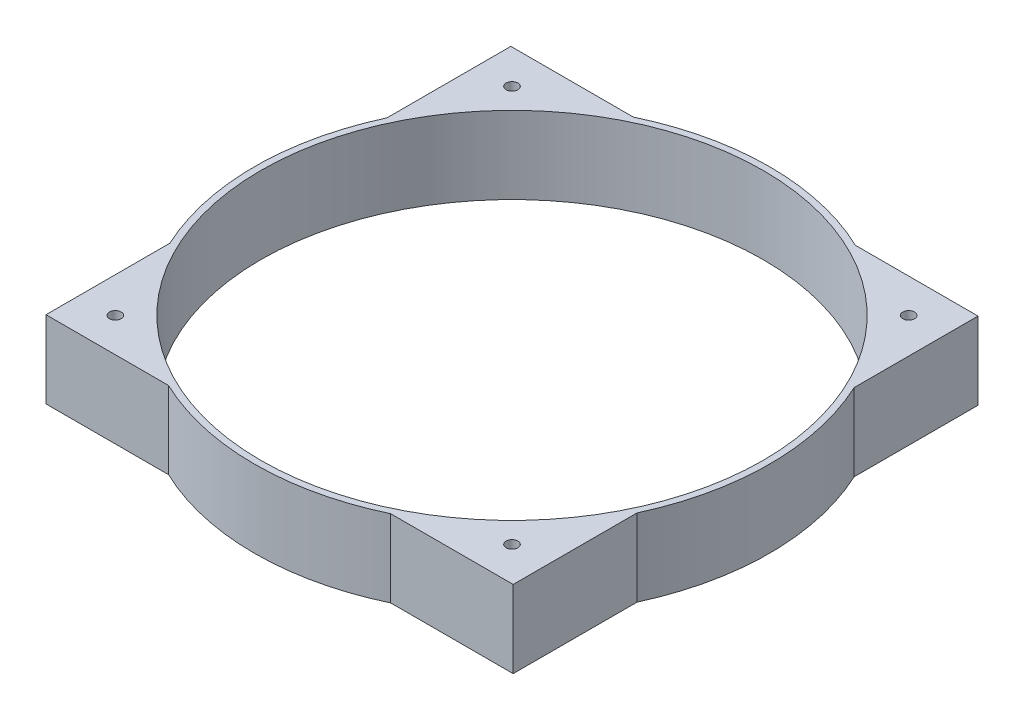
ISO-10303-21;
HEADER;
FILE_DESCRIPTION(('STEP AP214'),'2;1');
FILE_NAME('part.step','',(''),(''),'','','');
FILE_SCHEMA(('AUTOMOTIVE_DESIGN { 1 0 10303 214 1 1 1 1 }'));
ENDSEC;
DATA;
#1=APPLICATION_CONTEXT('core data for automotive mechanical design processes');
#2=APPLICATION_PROTOCOL_DEFINITION('international standard','automotive_design',2000,#1);
#3=PRODUCT_CONTEXT('',#1,'mechanical');
#4=PRODUCT('Part','Part','',(#3));
#5=PRODUCT_RELATED_PRODUCT_CATEGORY('part','',(#4));
#6=PRODUCT_DEFINITION_FORMATION('','',#4);
#7=PRODUCT_DEFINITION_CONTEXT('part definition',#1,'design');
#8=PRODUCT_DEFINITION('design','',#6,#7);
#9=PRODUCT_DEFINITION_SHAPE('','',#8);
#10=(LENGTH_UNIT() NAMED_UNIT(*) SI_UNIT(.MILLI.,.METRE.));
#11=(NAMED_UNIT(*) PLANE_ANGLE_UNIT() SI_UNIT($,.RADIAN.));
#12=(NAMED_UNIT(*) SI_UNIT($,.STERADIAN.) SOLID_ANGLE_UNIT());
#13=UNCERTAINTY_MEASURE_WITH_UNIT(LENGTH_MEASURE(1.E-05),#10,'distance_accuracy_value','');
#14=(GEOMETRIC_REPRESENTATION_CONTEXT(3) GLOBAL_UNCERTAINTY_ASSIGNED_CONTEXT((#13)) GLOBAL_UNIT_ASSIGNED_CONTEXT((#10,
#11,#12)) REPRESENTATION_CONTEXT('',''));
#15=CARTESIAN_POINT('',(0.,0.,0.));
#16=DIRECTION('',(0.,0.,1.));
#17=DIRECTION('',(1.,0.,0.));
#18=AXIS2_PLACEMENT_3D('',#15,#16,#17);
#19=CARTESIAN_POINT('',(0.,30.,0.));
#20=DIRECTION('',(0.,-1.,0.));
#21=DIRECTION('',(0.,0.,-1.));
#22=AXIS2_PLACEMENT_3D('',#19,#20,#21);
#23=CYLINDRICAL_SURFACE('',#22,100.);
#24=CARTESIAN_POINT('',(0.,30.,0.));
#25=DIRECTION('',(0.,1.,0.));
#26=DIRECTION('',(0.,0.,1.));
#27=AXIS2_PLACEMENT_3D('',#24,#25,#26);
#28=CIRCLE('',#27,100.);
#29=CARTESIAN_POINT('',(-90.6858149712351,30.,-42.1435993123856));
#30=VERTEX_POINT('',#29);
#31=CARTESIAN_POINT('',(-90.6858149712351,30.,42.1435993123856));
#32=VERTEX_POINT('',#31);
#33=EDGE_CURVE('E187',#30,#32,#28,.T.);
#34=ORIENTED_EDGE('',*,*,#33,.F.);
#35=DIRECTION('',(0.,-1.,0.));
#36=VECTOR('',#35,1.);
#37=CARTESIAN_POINT('',(-90.6858149712351,30.,-42.1435993123856));
#38=LINE('',#37,#36);
#39=CARTESIAN_POINT('',(-90.6858149712351,0.,-42.1435993123856));
#40=VERTEX_POINT('',#39);
#41=EDGE_CURVE('E141',#30,#40,#38,.T.);
#42=ORIENTED_EDGE('',*,*,#41,.T.);
#43=CARTESIAN_POINT('',(0.,0.,0.));
#44=DIRECTION('',(0.,1.,0.));
#45=DIRECTION('',(0.,0.,1.));
#46=AXIS2_PLACEMENT_3D('',#43,#44,#45);
#47=CIRCLE('',#46,100.);
#48=CARTESIAN_POINT('',(-90.6858149712351,0.,42.1435993123856));
#49=VERTEX_POINT('',#48);
#50=EDGE_CURVE('E190',#40,#49,#47,.T.);
#51=ORIENTED_EDGE('',*,*,#50,.T.);
#52=DIRECTION('',(0.,-1.,0.));
#53=VECTOR('',#52,1.);
#54=CARTESIAN_POINT('',(-90.6858149712351,30.,42.1435993123856));
#55=LINE('',#54,#53);
#56=EDGE_CURVE('E125',#49,#32,#55,.F.);
#57=ORIENTED_EDGE('',*,*,#56,.T.);
#58=EDGE_LOOP('',(#34,#42,#51,#57));
#59=FACE_BOUND('',#58,.T.);
#60=ADVANCED_FACE('F48',(#59),#23,.T.);
#61=CARTESIAN_POINT('',(0.,0.,0.));
#62=DIRECTION('',(0.,1.,0.));
#63=DIRECTION('',(0.,0.,1.));
#64=AXIS2_PLACEMENT_3D('',#61,#62,#63);
#65=PLANE('',#64);
#66=CARTESIAN_POINT('',(0.,0.,0.));
#67=DIRECTION('',(0.,-1.,0.));
#68=DIRECTION('',(0.,0.,-1.));
#69=AXIS2_PLACEMENT_3D('',#66,#67,#68);
#70=CIRCLE('',#69,97.5);
#71=CARTESIAN_POINT('',(0.,0.,-97.5));
#72=VERTEX_POINT('',#71);
#73=EDGE_CURVE('E256',#72,#72,#70,.T.);
#74=ORIENTED_EDGE('',*,*,#73,.F.);
#75=EDGE_LOOP('',(#74));
#76=FACE_BOUND('',#75,.T.);
#77=CARTESIAN_POINT('',(77.,0.,77.));
#78=DIRECTION('',(0.,1.,0.));
#79=DIRECTION('',(0.,0.,1.));
#80=AXIS2_PLACEMENT_3D('',#77,#78,#79);
#81=CIRCLE('',#80,2.27999999999998);
#82=CARTESIAN_POINT('',(77.,0.,79.28));
#83=VERTEX_POINT('',#82);
#84=EDGE_CURVE('E245',#83,#83,#81,.T.);
#85=ORIENTED_EDGE('',*,*,#84,.T.);
#86=EDGE_LOOP('',(#85));
#87=FACE_BOUND('',#86,.T.);
#88=CARTESIAN_POINT('',(-77.,0.,77.));
#89=DIRECTION('',(0.,1.,0.));
#90=DIRECTION('',(0.,0.,1.));
#91=AXIS2_PLACEMENT_3D('',#88,#89,#90);
#92=CIRCLE('',#91,2.28);
#93=CARTESIAN_POINT('',(-77.,0.,79.28));
#94=VERTEX_POINT('',#93);
#95=EDGE_CURVE('E239',#94,#94,#92,.T.);
#96=ORIENTED_EDGE('',*,*,#95,.T.);
#97=EDGE_LOOP('',(#96));
#98=FACE_BOUND('',#97,.T.);
#99=CARTESIAN_POINT('',(77.,0.,-77.));
#100=DIRECTION('',(0.,1.,0.));
#101=DIRECTION('',(0.,0.,1.));
#102=AXIS2_PLACEMENT_3D('',#99,#100,#101);
#103=CIRCLE('',#102,2.28);
#104=CARTESIAN_POINT('',(77.,0.,-74.72));
#105=VERTEX_POINT('',#104);
#106=EDGE_CURVE('E233',#105,#105,#103,.T.);
#107=ORIENTED_EDGE('',*,*,#106,.T.);
#108=EDGE_LOOP('',(#107));
#109=FACE_BOUND('',#108,.T.);
#110=CARTESIAN_POINT('',(-77.,0.,-77.));
#111=DIRECTION('',(0.,1.,0.));
#112=DIRECTION('',(0.,0.,1.));
#113=AXIS2_PLACEMENT_3D('',#110,#111,#112);
#114=CIRCLE('',#113,2.28);
#115=CARTESIAN_POINT('',(-77.,0.,-74.72));
#116=VERTEX_POINT('',#115);
#117=EDGE_CURVE('E232',#116,#116,#114,.T.);
#118=ORIENTED_EDGE('',*,*,#117,.T.);
#119=EDGE_LOOP('',(#118));
#120=FACE_BOUND('',#119,.T.);
#121=ORIENTED_EDGE('',*,*,#50,.F.);
#122=DIRECTION('',(0.,0.,-1.));
#123=VECTOR('',#122,1.);
#124=CARTESIAN_POINT('',(-90.6858149712351,0.,90.2278058047137));
#125=LINE('',#124,#123);
#126=CARTESIAN_POINT('',(-90.6858149712351,0.,-90.2278058047137));
#127=VERTEX_POINT('',#126);
#128=EDGE_CURVE('E95',#40,#127,#125,.T.);
#129=ORIENTED_EDGE('',*,*,#128,.T.);
#130=DIRECTION('',(1.,0.,0.));
#131=VECTOR('',#130,1.);
#132=CARTESIAN_POINT('',(-90.6858149712351,0.,-90.2278058047137));
#133=LINE('',#132,#131);
#134=CARTESIAN_POINT('',(-43.115461955856,0.,-90.2278058047137));
#135=VERTEX_POINT('',#134);
#136=EDGE_CURVE('E129',#127,#135,#133,.T.);
#137=ORIENTED_EDGE('',*,*,#136,.T.);
#138=CARTESIAN_POINT('',(43.115461955856,0.,-90.2278058047137));
#139=VERTEX_POINT('',#138);
#140=EDGE_CURVE('E184',#139,#135,#47,.T.);
#141=ORIENTED_EDGE('',*,*,#140,.F.);
#142=CARTESIAN_POINT('',(90.6858149712351,0.,-90.2278058047137));
#143=VERTEX_POINT('',#142);
#144=EDGE_CURVE('E178',#139,#143,#133,.T.);
#145=ORIENTED_EDGE('',*,*,#144,.T.);
#146=DIRECTION('',(0.,0.,-1.));
#147=VECTOR('',#146,1.);
#148=CARTESIAN_POINT('',(90.6858149712351,0.,90.2278058047137));
#149=LINE('',#148,#147);
#150=CARTESIAN_POINT('',(90.6858149712351,0.,-42.1435993123856));
#151=VERTEX_POINT('',#150);
#152=EDGE_CURVE('E120',#151,#143,#149,.T.);
#153=ORIENTED_EDGE('',*,*,#152,.F.);
#154=CARTESIAN_POINT('',(90.6858149712351,0.,42.1435993123856));
#155=VERTEX_POINT('',#154);
#156=EDGE_CURVE('E175',#155,#151,#47,.T.);
#157=ORIENTED_EDGE('',*,*,#156,.F.);
#158=CARTESIAN_POINT('',(90.6858149712351,0.,90.2278058047137));
#159=VERTEX_POINT('',#158);
#160=EDGE_CURVE('E179',#159,#155,#149,.T.);
#161=ORIENTED_EDGE('',*,*,#160,.F.);
#162=DIRECTION('',(1.,0.,0.));
#163=VECTOR('',#162,1.);
#164=CARTESIAN_POINT('',(-90.6858149712351,0.,90.2278058047137));
#165=LINE('',#164,#163);
#166=CARTESIAN_POINT('',(43.115461955856,0.,90.2278058047137));
#167=VERTEX_POINT('',#166);
#168=EDGE_CURVE('E121',#167,#159,#165,.T.);
#169=ORIENTED_EDGE('',*,*,#168,.F.);
#170=CARTESIAN_POINT('',(-43.115461955856,0.,90.2278058047137));
#171=VERTEX_POINT('',#170);
#172=EDGE_CURVE('E119',#171,#167,#47,.T.);
#173=ORIENTED_EDGE('',*,*,#172,.F.);
#174=CARTESIAN_POINT('',(-90.6858149712351,0.,90.2278058047137));
#175=VERTEX_POINT('',#174);
#176=EDGE_CURVE('E102',#175,#171,#165,.T.);
#177=ORIENTED_EDGE('',*,*,#176,.F.);
#178=EDGE_CURVE('E115',#175,#49,#125,.T.);
#179=ORIENTED_EDGE('',*,*,#178,.T.);
#180=EDGE_LOOP('',(#121,#129,#137,#141,#145,#153,#157,#161,#169,#173,#177,#179));
#181=FACE_BOUND('',#180,.T.);
#182=ADVANCED_FACE('F113',(#76,#87,#98,#109,#120,#181),#65,.F.);
#183=CARTESIAN_POINT('',(0.,30.,0.));
#184=DIRECTION('',(0.,1.,0.));
#185=DIRECTION('',(0.,0.,1.));
#186=AXIS2_PLACEMENT_3D('',#183,#184,#185);
#187=PLANE('',#186);
#188=CARTESIAN_POINT('',(0.,30.,0.));
#189=DIRECTION('',(0.,1.,0.));
#190=DIRECTION('',(0.,0.,1.));
#191=AXIS2_PLACEMENT_3D('',#188,#189,#190);
#192=CIRCLE('',#191,97.5);
#193=CARTESIAN_POINT('',(0.,30.,97.5));
#194=VERTEX_POINT('',#193);
#195=EDGE_CURVE('E251',#194,#194,#192,.F.);
#196=ORIENTED_EDGE('',*,*,#195,.T.);
#197=EDGE_LOOP('',(#196));
#198=FACE_BOUND('',#197,.T.);
#199=CARTESIAN_POINT('',(77.,30.,77.));
#200=DIRECTION('',(0.,1.,0.));
#201=DIRECTION('',(0.,0.,1.));
#202=AXIS2_PLACEMENT_3D('',#199,#200,#201);
#203=CIRCLE('',#202,2.27999999999998);
#204=CARTESIAN_POINT('',(77.,30.,79.28));
#205=VERTEX_POINT('',#204);
#206=EDGE_CURVE('E248',#205,#205,#203,.T.);
#207=ORIENTED_EDGE('',*,*,#206,.F.);
#208=EDGE_LOOP('',(#207));
#209=FACE_BOUND('',#208,.T.);
#210=CARTESIAN_POINT('',(-77.,30.,77.));
#211=DIRECTION('',(0.,1.,0.));
#212=DIRECTION('',(0.,0.,1.));
#213=AXIS2_PLACEMENT_3D('',#210,#211,#212);
#214=CIRCLE('',#213,2.28);
#215=CARTESIAN_POINT('',(-77.,30.,79.28));
#216=VERTEX_POINT('',#215);
#217=EDGE_CURVE('E242',#216,#216,#214,.T.);
#218=ORIENTED_EDGE('',*,*,#217,.F.);
#219=EDGE_LOOP('',(#218));
#220=FACE_BOUND('',#219,.T.);
#221=CARTESIAN_POINT('',(77.,30.,-77.));
#222=DIRECTION('',(0.,1.,0.));
#223=DIRECTION('',(0.,0.,1.));
#224=AXIS2_PLACEMENT_3D('',#221,#222,#223);
#225=CIRCLE('',#224,2.28);
#226=CARTESIAN_POINT('',(77.,30.,-74.72));
#227=VERTEX_POINT('',#226);
#228=EDGE_CURVE('E236',#227,#227,#225,.T.);
#229=ORIENTED_EDGE('',*,*,#228,.F.);
#230=EDGE_LOOP('',(#229));
#231=FACE_BOUND('',#230,.T.);
#232=CARTESIAN_POINT('',(-77.,30.,-77.));
#233=DIRECTION('',(0.,1.,0.));
#234=DIRECTION('',(0.,0.,1.));
#235=AXIS2_PLACEMENT_3D('',#232,#233,#234);
#236=CIRCLE('',#235,2.28);
#237=CARTESIAN_POINT('',(-77.,30.,-74.72));
#238=VERTEX_POINT('',#237);
#239=EDGE_CURVE('E229',#238,#238,#236,.T.);
#240=ORIENTED_EDGE('',*,*,#239,.F.);
#241=EDGE_LOOP('',(#240));
#242=FACE_BOUND('',#241,.T.);
#243=ORIENTED_EDGE('',*,*,#33,.T.);
#244=DIRECTION('',(0.,0.,-1.));
#245=VECTOR('',#244,1.);
#246=CARTESIAN_POINT('',(-90.6858149712351,30.,90.2278058047137));
#247=LINE('',#246,#245);
#248=CARTESIAN_POINT('',(-90.6858149712351,30.,90.2278058047137));
#249=VERTEX_POINT('',#248);
#250=EDGE_CURVE('E110',#249,#32,#247,.T.);
#251=ORIENTED_EDGE('',*,*,#250,.F.);
#252=DIRECTION('',(1.,0.,0.));
#253=VECTOR('',#252,1.);
#254=CARTESIAN_POINT('',(-90.6858149712351,30.,90.2278058047137));
#255=LINE('',#254,#253);
#256=CARTESIAN_POINT('',(-43.115461955856,30.,90.2278058047137));
#257=VERTEX_POINT('',#256);
#258=EDGE_CURVE('E104',#249,#257,#255,.T.);
#259=ORIENTED_EDGE('',*,*,#258,.T.);
#260=CARTESIAN_POINT('',(43.115461955856,30.,90.2278058047137));
#261=VERTEX_POINT('',#260);
#262=EDGE_CURVE('E183',#257,#261,#28,.T.);
#263=ORIENTED_EDGE('',*,*,#262,.T.);
#264=CARTESIAN_POINT('',(90.6858149712351,30.,90.2278058047137));
#265=VERTEX_POINT('',#264);
#266=EDGE_CURVE('E126',#261,#265,#255,.T.);
#267=ORIENTED_EDGE('',*,*,#266,.T.);
#268=DIRECTION('',(0.,0.,-1.));
#269=VECTOR('',#268,1.);
#270=CARTESIAN_POINT('',(90.6858149712351,30.,90.2278058047137));
#271=LINE('',#270,#269);
#272=CARTESIAN_POINT('',(90.6858149712351,30.,42.1435993123856));
#273=VERTEX_POINT('',#272);
#274=EDGE_CURVE('E310',#265,#273,#271,.T.);
#275=ORIENTED_EDGE('',*,*,#274,.T.);
#276=CARTESIAN_POINT('',(90.6858149712351,30.,-42.1435993123856));
#277=VERTEX_POINT('',#276);
#278=EDGE_CURVE('E142',#273,#277,#28,.T.);
#279=ORIENTED_EDGE('',*,*,#278,.T.);
#280=CARTESIAN_POINT('',(90.6858149712351,30.,-90.2278058047137));
#281=VERTEX_POINT('',#280);
#282=EDGE_CURVE('E165',#277,#281,#271,.T.);
#283=ORIENTED_EDGE('',*,*,#282,.T.);
#284=DIRECTION('',(1.,0.,0.));
#285=VECTOR('',#284,1.);
#286=CARTESIAN_POINT('',(-90.6858149712351,30.,-90.2278058047137));
#287=LINE('',#286,#285);
#288=CARTESIAN_POINT('',(43.115461955856,30.,-90.2278058047137));
#289=VERTEX_POINT('',#288);
#290=EDGE_CURVE('E313',#289,#281,#287,.T.);
#291=ORIENTED_EDGE('',*,*,#290,.F.);
#292=CARTESIAN_POINT('',(-43.115461955856,30.,-90.2278058047137));
#293=VERTEX_POINT('',#292);
#294=EDGE_CURVE('E227',#289,#293,#28,.T.);
#295=ORIENTED_EDGE('',*,*,#294,.T.);
#296=CARTESIAN_POINT('',(-90.6858149712351,30.,-90.2278058047137));
#297=VERTEX_POINT('',#296);
#298=EDGE_CURVE('E225',#297,#293,#287,.T.);
#299=ORIENTED_EDGE('',*,*,#298,.F.);
#300=EDGE_CURVE('E217',#30,#297,#247,.T.);
#301=ORIENTED_EDGE('',*,*,#300,.F.);
#302=EDGE_LOOP('',(#243,#251,#259,#263,#267,#275,#279,#283,#291,#295,#299,#301));
#303=FACE_BOUND('',#302,.T.);
#304=ADVANCED_FACE('F222',(#198,#209,#220,#231,#242,#303),#187,.T.);
#305=ORIENTED_EDGE('',*,*,#294,.F.);
#306=DIRECTION('',(0.,-1.,0.));
#307=VECTOR('',#306,1.);
#308=CARTESIAN_POINT('',(43.115461955856,30.,-90.2278058047137));
#309=LINE('',#308,#307);
#310=EDGE_CURVE('E148',#289,#139,#309,.T.);
#311=ORIENTED_EDGE('',*,*,#310,.T.);
#312=ORIENTED_EDGE('',*,*,#140,.T.);
#313=DIRECTION('',(0.,-1.,0.));
#314=VECTOR('',#313,1.);
#315=CARTESIAN_POINT('',(-43.115461955856,30.,-90.2278058047137));
#316=LINE('',#315,#314);
#317=EDGE_CURVE('E145',#135,#293,#316,.F.);
#318=ORIENTED_EDGE('',*,*,#317,.T.);
#319=EDGE_LOOP('',(#305,#311,#312,#318));
#320=FACE_BOUND('',#319,.T.);
#321=ADVANCED_FACE('F283',(#320),#23,.T.);
#322=DIRECTION('',(0.,-1.,0.));
#323=VECTOR('',#322,1.);
#324=CARTESIAN_POINT('',(90.6858149712351,30.,-42.1435993123856));
#325=LINE('',#324,#323);
#326=EDGE_CURVE('E154',#277,#151,#325,.T.);
#327=ORIENTED_EDGE('',*,*,#326,.F.);
#328=ORIENTED_EDGE('',*,*,#278,.F.);
#329=DIRECTION('',(0.,-1.,0.));
#330=VECTOR('',#329,1.);
#331=CARTESIAN_POINT('',(90.6858149712351,30.,42.1435993123856));
#332=LINE('',#331,#330);
#333=EDGE_CURVE('E151',#155,#273,#332,.F.);
#334=ORIENTED_EDGE('',*,*,#333,.F.);
#335=ORIENTED_EDGE('',*,*,#156,.T.);
#336=EDGE_LOOP('',(#327,#328,#334,#335));
#337=FACE_BOUND('',#336,.T.);
#338=ADVANCED_FACE('F181',(#337),#23,.T.);
#339=DIRECTION('',(0.,-1.,0.));
#340=VECTOR('',#339,1.);
#341=CARTESIAN_POINT('',(43.115461955856,30.,90.2278058047137));
#342=LINE('',#341,#340);
#343=EDGE_CURVE('E12',#261,#167,#342,.T.);
#344=ORIENTED_EDGE('',*,*,#343,.F.);
#345=ORIENTED_EDGE('',*,*,#262,.F.);
#346=DIRECTION('',(0.,-1.,0.));
#347=VECTOR('',#346,1.);
#348=CARTESIAN_POINT('',(-43.115461955856,30.,90.2278058047137));
#349=LINE('',#348,#347);
#350=EDGE_CURVE('E57',#171,#257,#349,.F.);
#351=ORIENTED_EDGE('',*,*,#350,.F.);
#352=ORIENTED_EDGE('',*,*,#172,.T.);
#353=EDGE_LOOP('',(#344,#345,#351,#352));
#354=FACE_BOUND('',#353,.T.);
#355=ADVANCED_FACE('F294',(#354),#23,.T.);
#356=CARTESIAN_POINT('',(-90.6858149712351,30.,90.2278058047137));
#357=DIRECTION('',(0.,0.,-1.));
#358=DIRECTION('',(-1.,0.,0.));
#359=AXIS2_PLACEMENT_3D('',#356,#357,#358);
#360=PLANE('',#359);
#361=ORIENTED_EDGE('',*,*,#176,.T.);
#362=ORIENTED_EDGE('',*,*,#350,.T.);
#363=ORIENTED_EDGE('',*,*,#258,.F.);
#364=DIRECTION('',(0.,-1.,0.));
#365=VECTOR('',#364,1.);
#366=CARTESIAN_POINT('',(-90.6858149712351,30.,90.2278058047137));
#367=LINE('',#366,#365);
#368=EDGE_CURVE('E98',#249,#175,#367,.T.);
#369=ORIENTED_EDGE('',*,*,#368,.T.);
#370=EDGE_LOOP('',(#361,#362,#363,#369));
#371=FACE_BOUND('',#370,.T.);
#372=ADVANCED_FACE('F100',(#371),#360,.F.);
#373=CARTESIAN_POINT('',(-90.6858149712351,30.,90.2278058047137));
#374=DIRECTION('',(-1.,0.,0.));
#375=DIRECTION('',(0.,0.,1.));
#376=AXIS2_PLACEMENT_3D('',#373,#374,#375);
#377=PLANE('',#376);
#378=ORIENTED_EDGE('',*,*,#56,.F.);
#379=ORIENTED_EDGE('',*,*,#178,.F.);
#380=ORIENTED_EDGE('',*,*,#368,.F.);
#381=ORIENTED_EDGE('',*,*,#250,.T.);
#382=EDGE_LOOP('',(#378,#379,#380,#381));
#383=FACE_BOUND('',#382,.T.);
#384=ADVANCED_FACE('F124',(#383),#377,.T.);
#385=ORIENTED_EDGE('',*,*,#41,.F.);
#386=ORIENTED_EDGE('',*,*,#300,.T.);
#387=DIRECTION('',(0.,-1.,0.));
#388=VECTOR('',#387,1.);
#389=CARTESIAN_POINT('',(-90.6858149712351,30.,-90.2278058047137));
#390=LINE('',#389,#388);
#391=EDGE_CURVE('E109',#297,#127,#390,.T.);
#392=ORIENTED_EDGE('',*,*,#391,.T.);
#393=ORIENTED_EDGE('',*,*,#128,.F.);
#394=EDGE_LOOP('',(#385,#386,#392,#393));
#395=FACE_BOUND('',#394,.T.);
#396=ADVANCED_FACE('F216',(#395),#377,.T.);
#397=CARTESIAN_POINT('',(-90.6858149712351,30.,-90.2278058047137));
#398=DIRECTION('',(0.,0.,-1.));
#399=DIRECTION('',(-1.,0.,0.));
#400=AXIS2_PLACEMENT_3D('',#397,#398,#399);
#401=PLANE('',#400);
#402=ORIENTED_EDGE('',*,*,#317,.F.);
#403=ORIENTED_EDGE('',*,*,#136,.F.);
#404=ORIENTED_EDGE('',*,*,#391,.F.);
#405=ORIENTED_EDGE('',*,*,#298,.T.);
#406=EDGE_LOOP('',(#402,#403,#404,#405));
#407=FACE_BOUND('',#406,.T.);
#408=ADVANCED_FACE('F329',(#407),#401,.T.);
#409=ORIENTED_EDGE('',*,*,#310,.F.);
#410=ORIENTED_EDGE('',*,*,#290,.T.);
#411=DIRECTION('',(0.,-1.,0.));
#412=VECTOR('',#411,1.);
#413=CARTESIAN_POINT('',(90.6858149712351,30.,-90.2278058047137));
#414=LINE('',#413,#412);
#415=EDGE_CURVE('E134',#281,#143,#414,.T.);
#416=ORIENTED_EDGE('',*,*,#415,.T.);
#417=ORIENTED_EDGE('',*,*,#144,.F.);
#418=EDGE_LOOP('',(#409,#410,#416,#417));
#419=FACE_BOUND('',#418,.T.);
#420=ADVANCED_FACE('F321',(#419),#401,.T.);
#421=CARTESIAN_POINT('',(90.6858149712351,30.,90.2278058047137));
#422=DIRECTION('',(-1.,0.,0.));
#423=DIRECTION('',(0.,0.,1.));
#424=AXIS2_PLACEMENT_3D('',#421,#422,#423);
#425=PLANE('',#424);
#426=ORIENTED_EDGE('',*,*,#282,.F.);
#427=ORIENTED_EDGE('',*,*,#326,.T.);
#428=ORIENTED_EDGE('',*,*,#152,.T.);
#429=ORIENTED_EDGE('',*,*,#415,.F.);
#430=EDGE_LOOP('',(#426,#427,#428,#429));
#431=FACE_BOUND('',#430,.T.);
#432=ADVANCED_FACE('F161',(#431),#425,.F.);
#433=ORIENTED_EDGE('',*,*,#160,.T.);
#434=ORIENTED_EDGE('',*,*,#333,.T.);
#435=ORIENTED_EDGE('',*,*,#274,.F.);
#436=DIRECTION('',(0.,-1.,0.));
#437=VECTOR('',#436,1.);
#438=CARTESIAN_POINT('',(90.6858149712351,30.,90.2278058047137));
#439=LINE('',#438,#437);
#440=EDGE_CURVE('E137',#265,#159,#439,.T.);
#441=ORIENTED_EDGE('',*,*,#440,.T.);
#442=EDGE_LOOP('',(#433,#434,#435,#441));
#443=FACE_BOUND('',#442,.T.);
#444=ADVANCED_FACE('F279',(#443),#425,.F.);
#445=ORIENTED_EDGE('',*,*,#266,.F.);
#446=ORIENTED_EDGE('',*,*,#343,.T.);
#447=ORIENTED_EDGE('',*,*,#168,.T.);
#448=ORIENTED_EDGE('',*,*,#440,.F.);
#449=EDGE_LOOP('',(#445,#446,#447,#448));
#450=FACE_BOUND('',#449,.T.);
#451=ADVANCED_FACE('F50',(#450),#360,.F.);
#452=CARTESIAN_POINT('',(-77.,0.,-77.));
#453=DIRECTION('',(0.,1.,0.));
#454=DIRECTION('',(0.,0.,1.));
#455=AXIS2_PLACEMENT_3D('',#452,#453,#454);
#456=CYLINDRICAL_SURFACE('',#455,2.28);
#457=ORIENTED_EDGE('',*,*,#117,.F.);
#458=EDGE_LOOP('',(#457));
#459=FACE_BOUND('',#458,.T.);
#460=ORIENTED_EDGE('',*,*,#239,.T.);
#461=EDGE_LOOP('',(#460));
#462=FACE_BOUND('',#461,.T.);
#463=ADVANCED_FACE('F274',(#459,#462),#456,.F.);
#464=CARTESIAN_POINT('',(77.,0.,-77.));
#465=DIRECTION('',(0.,1.,0.));
#466=DIRECTION('',(0.,0.,1.));
#467=AXIS2_PLACEMENT_3D('',#464,#465,#466);
#468=CYLINDRICAL_SURFACE('',#467,2.28);
#469=ORIENTED_EDGE('',*,*,#106,.F.);
#470=EDGE_LOOP('',(#469));
#471=FACE_BOUND('',#470,.T.);
#472=ORIENTED_EDGE('',*,*,#228,.T.);
#473=EDGE_LOOP('',(#472));
#474=FACE_BOUND('',#473,.T.);
#475=ADVANCED_FACE('F277',(#471,#474),#468,.F.);
#476=CARTESIAN_POINT('',(-77.,0.,77.));
#477=DIRECTION('',(0.,1.,0.));
#478=DIRECTION('',(0.,0.,1.));
#479=AXIS2_PLACEMENT_3D('',#476,#477,#478);
#480=CYLINDRICAL_SURFACE('',#479,2.28);
#481=ORIENTED_EDGE('',*,*,#95,.F.);
#482=EDGE_LOOP('',(#481));
#483=FACE_BOUND('',#482,.T.);
#484=ORIENTED_EDGE('',*,*,#217,.T.);
#485=EDGE_LOOP('',(#484));
#486=FACE_BOUND('',#485,.T.);
#487=ADVANCED_FACE('F380',(#483,#486),#480,.F.);
#488=CARTESIAN_POINT('',(77.,0.,77.));
#489=DIRECTION('',(0.,1.,0.));
#490=DIRECTION('',(0.,0.,1.));
#491=AXIS2_PLACEMENT_3D('',#488,#489,#490);
#492=CYLINDRICAL_SURFACE('',#491,2.27999999999998);
#493=ORIENTED_EDGE('',*,*,#84,.F.);
#494=EDGE_LOOP('',(#493));
#495=FACE_BOUND('',#494,.T.);
#496=ORIENTED_EDGE('',*,*,#206,.T.);
#497=EDGE_LOOP('',(#496));
#498=FACE_BOUND('',#497,.T.);
#499=ADVANCED_FACE('F375',(#495,#498),#492,.F.);
#500=CARTESIAN_POINT('',(0.,305.771644662754,0.));
#501=DIRECTION('',(0.,-1.,0.));
#502=DIRECTION('',(0.,0.,-1.));
#503=AXIS2_PLACEMENT_3D('',#500,#501,#502);
#504=CYLINDRICAL_SURFACE('',#503,97.5);
#505=ORIENTED_EDGE('',*,*,#73,.T.);
#506=EDGE_LOOP('',(#505));
#507=FACE_BOUND('',#506,.T.);
#508=ORIENTED_EDGE('',*,*,#195,.F.);
#509=EDGE_LOOP('',(#508));
#510=FACE_BOUND('',#509,.T.);
#511=ADVANCED_FACE('F260',(#507,#510),#504,.F.);
#512=CLOSED_SHELL('',(#60,#182,#304,#321,#338,#355,#372,#384,#396,#408,#420,#432,#444,#451,#463,
#475,#487,#499,#511));
#513=MANIFOLD_SOLID_BREP('B2',#512);
#514=ADVANCED_BREP_SHAPE_REPRESENTATION('',(#18,#513),#14);
#515=SHAPE_DEFINITION_REPRESENTATION(#9,#514);
ENDSEC;
END-ISO-10303-21;
